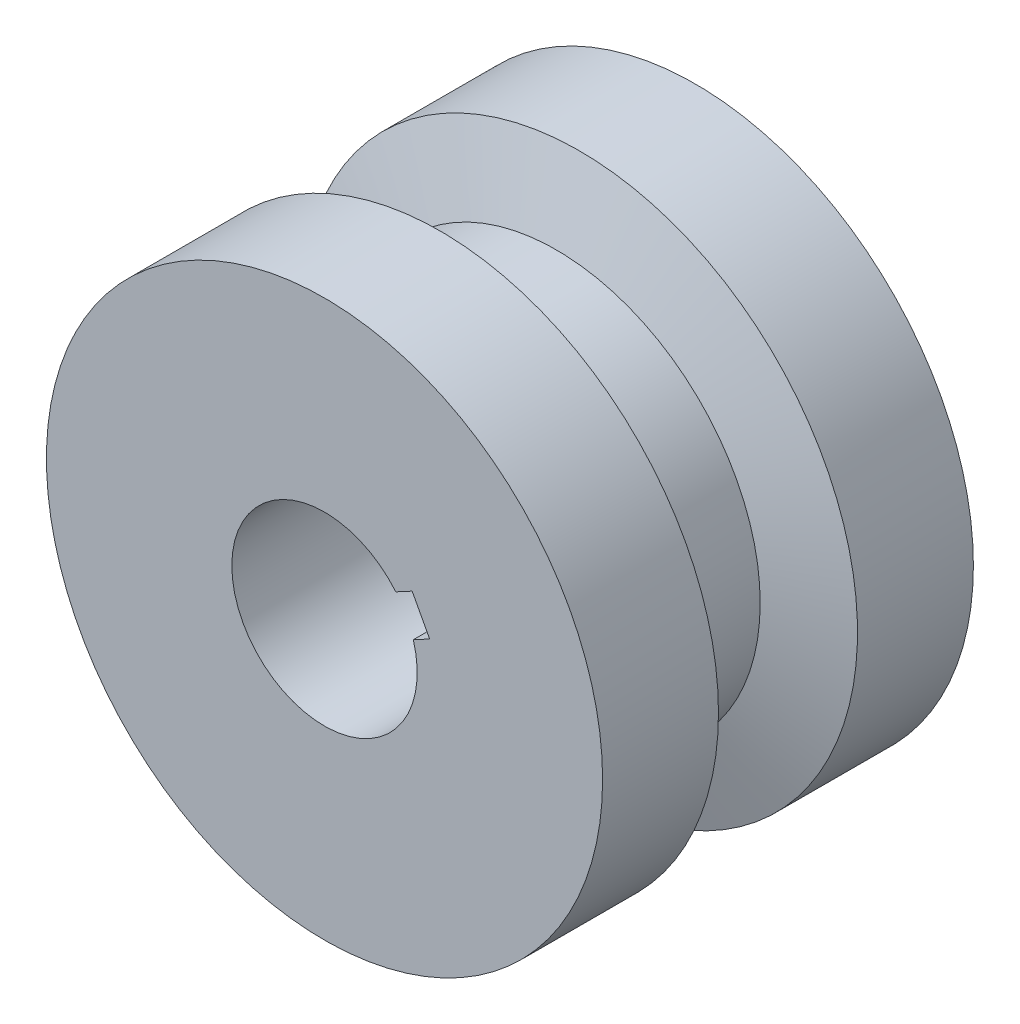
ISO-10303-21;
HEADER;
FILE_DESCRIPTION(('STEP AP214'),'2;1');
FILE_NAME('part.step','',(''),(''),'','','');
FILE_SCHEMA(('AUTOMOTIVE_DESIGN { 1 0 10303 214 1 1 1 1 }'));
ENDSEC;
DATA;
#1=APPLICATION_CONTEXT('core data for automotive mechanical design processes');
#2=APPLICATION_PROTOCOL_DEFINITION('international standard','automotive_design',2000,#1);
#3=PRODUCT_CONTEXT('',#1,'mechanical');
#4=PRODUCT('Part','Part','',(#3));
#5=PRODUCT_RELATED_PRODUCT_CATEGORY('part','',(#4));
#6=PRODUCT_DEFINITION_FORMATION('','',#4);
#7=PRODUCT_DEFINITION_CONTEXT('part definition',#1,'design');
#8=PRODUCT_DEFINITION('design','',#6,#7);
#9=PRODUCT_DEFINITION_SHAPE('','',#8);
#10=(LENGTH_UNIT() NAMED_UNIT(*) SI_UNIT(.MILLI.,.METRE.));
#11=(NAMED_UNIT(*) PLANE_ANGLE_UNIT() SI_UNIT($,.RADIAN.));
#12=(NAMED_UNIT(*) SI_UNIT($,.STERADIAN.) SOLID_ANGLE_UNIT());
#13=UNCERTAINTY_MEASURE_WITH_UNIT(LENGTH_MEASURE(1.E-05),#10,'distance_accuracy_value','');
#14=(GEOMETRIC_REPRESENTATION_CONTEXT(3) GLOBAL_UNCERTAINTY_ASSIGNED_CONTEXT((#13)) GLOBAL_UNIT_ASSIGNED_CONTEXT((#10,
#11,#12)) REPRESENTATION_CONTEXT('',''));
#15=CARTESIAN_POINT('',(0.,0.,0.));
#16=DIRECTION('',(0.,0.,1.));
#17=DIRECTION('',(1.,0.,0.));
#18=AXIS2_PLACEMENT_3D('',#15,#16,#17);
#19=CARTESIAN_POINT('',(0.,0.,5.));
#20=DIRECTION('',(0.,0.,-1.));
#21=DIRECTION('',(-1.,0.,0.));
#22=AXIS2_PLACEMENT_3D('',#19,#20,#21);
#23=CYLINDRICAL_SURFACE('',#22,7.5);
#24=CARTESIAN_POINT('',(0.,0.,5.));
#25=DIRECTION('',(0.,0.,1.));
#26=DIRECTION('',(1.,0.,0.));
#27=AXIS2_PLACEMENT_3D('',#24,#25,#26);
#28=CIRCLE('',#27,7.5);
#29=CARTESIAN_POINT('',(7.5,0.,5.));
#30=VERTEX_POINT('',#29);
#31=EDGE_CURVE('E13',#30,#30,#28,.T.);
#32=ORIENTED_EDGE('',*,*,#31,.F.);
#33=EDGE_LOOP('',(#32));
#34=FACE_BOUND('',#33,.T.);
#35=CARTESIAN_POINT('',(0.,0.,1.875));
#36=DIRECTION('',(0.,0.,1.));
#37=DIRECTION('',(1.,0.,0.));
#38=AXIS2_PLACEMENT_3D('',#35,#36,#37);
#39=CIRCLE('',#38,7.5);
#40=CARTESIAN_POINT('',(7.5,0.,1.875));
#41=VERTEX_POINT('',#40);
#42=EDGE_CURVE('E49',#41,#41,#39,.F.);
#43=ORIENTED_EDGE('',*,*,#42,.F.);
#44=EDGE_LOOP('',(#43));
#45=FACE_BOUND('',#44,.T.);
#46=ADVANCED_FACE('F46',(#34,#45),#23,.T.);
#47=CARTESIAN_POINT('',(0.,0.,-5.));
#48=DIRECTION('',(0.,0.,1.));
#49=DIRECTION('',(1.,0.,0.));
#50=AXIS2_PLACEMENT_3D('',#47,#48,#49);
#51=CIRCLE('',#50,7.5);
#52=CARTESIAN_POINT('',(7.5,0.,-5.));
#53=VERTEX_POINT('',#52);
#54=EDGE_CURVE('E54',#53,#53,#51,.T.);
#55=ORIENTED_EDGE('',*,*,#54,.T.);
#56=EDGE_LOOP('',(#55));
#57=FACE_BOUND('',#56,.T.);
#58=CARTESIAN_POINT('',(0.,0.,-1.875));
#59=DIRECTION('',(0.,0.,-1.));
#60=DIRECTION('',(-1.,0.,0.));
#61=AXIS2_PLACEMENT_3D('',#58,#59,#60);
#62=CIRCLE('',#61,7.5);
#63=CARTESIAN_POINT('',(-7.5,0.,-1.875));
#64=VERTEX_POINT('',#63);
#65=EDGE_CURVE('E127',#64,#64,#62,.F.);
#66=ORIENTED_EDGE('',*,*,#65,.F.);
#67=EDGE_LOOP('',(#66));
#68=FACE_BOUND('',#67,.T.);
#69=ADVANCED_FACE('F142',(#57,#68),#23,.T.);
#70=CARTESIAN_POINT('',(0.,0.,5.));
#71=DIRECTION('',(0.,0.,1.));
#72=DIRECTION('',(1.,0.,0.));
#73=AXIS2_PLACEMENT_3D('',#70,#71,#72);
#74=PLANE('',#73);
#75=DIRECTION('',(-0.881462672280858,-0.472253700224243,0.));
#76=VECTOR('',#75,1.);
#77=CARTESIAN_POINT('',(2.39526062451033,0.716049258550253,5.));
#78=LINE('',#77,#76);
#79=CARTESIAN_POINT('',(2.83599196065076,0.952176108662375,5.));
#80=VERTEX_POINT('',#79);
#81=CARTESIAN_POINT('',(2.39526062451033,0.716049258550253,5.));
#82=VERTEX_POINT('',#81);
#83=EDGE_CURVE('E104',#80,#82,#78,.T.);
#84=ORIENTED_EDGE('',*,*,#83,.T.);
#85=CARTESIAN_POINT('',(0.,0.,5.));
#86=DIRECTION('',(0.,0.,1.));
#87=DIRECTION('',(1.,0.,0.));
#88=AXIS2_PLACEMENT_3D('',#85,#86,#87);
#89=CIRCLE('',#88,2.5);
#90=CARTESIAN_POINT('',(1.92300692428609,1.59751193083111,5.));
#91=VERTEX_POINT('',#90);
#92=EDGE_CURVE('E110',#91,#82,#89,.T.);
#93=ORIENTED_EDGE('',*,*,#92,.F.);
#94=DIRECTION('',(0.881462672280858,0.472253700224243,0.));
#95=VECTOR('',#94,1.);
#96=CARTESIAN_POINT('',(2.36373826042652,1.83363878094323,5.));
#97=LINE('',#96,#95);
#98=CARTESIAN_POINT('',(2.36373826042652,1.83363878094323,5.));
#99=VERTEX_POINT('',#98);
#100=EDGE_CURVE('E62',#91,#99,#97,.T.);
#101=ORIENTED_EDGE('',*,*,#100,.T.);
#102=DIRECTION('',(0.472253700224242,-0.881462672280858,0.));
#103=VECTOR('',#102,1.);
#104=CARTESIAN_POINT('',(2.83599196065076,0.952176108662375,5.));
#105=LINE('',#104,#103);
#106=EDGE_CURVE('E101',#99,#80,#105,.T.);
#107=ORIENTED_EDGE('',*,*,#106,.T.);
#108=EDGE_LOOP('',(#84,#93,#101,#107));
#109=FACE_BOUND('',#108,.T.);
#110=ORIENTED_EDGE('',*,*,#31,.T.);
#111=EDGE_LOOP('',(#110));
#112=FACE_BOUND('',#111,.T.);
#113=ADVANCED_FACE('F107',(#109,#112),#74,.T.);
#114=CARTESIAN_POINT('',(0.,0.,-5.));
#115=DIRECTION('',(0.,0.,1.));
#116=DIRECTION('',(1.,0.,0.));
#117=AXIS2_PLACEMENT_3D('',#114,#115,#116);
#118=PLANE('',#117);
#119=ORIENTED_EDGE('',*,*,#54,.F.);
#120=EDGE_LOOP('',(#119));
#121=FACE_BOUND('',#120,.T.);
#122=CARTESIAN_POINT('',(0.,0.,-5.));
#123=DIRECTION('',(0.,0.,1.));
#124=DIRECTION('',(1.,0.,0.));
#125=AXIS2_PLACEMENT_3D('',#122,#123,#124);
#126=CIRCLE('',#125,2.5);
#127=CARTESIAN_POINT('',(1.92300692428609,1.59751193083111,-5.));
#128=VERTEX_POINT('',#127);
#129=CARTESIAN_POINT('',(2.39526062451033,0.716049258550253,-5.));
#130=VERTEX_POINT('',#129);
#131=EDGE_CURVE('E129',#128,#130,#126,.T.);
#132=ORIENTED_EDGE('',*,*,#131,.T.);
#133=DIRECTION('',(-0.881462672280858,-0.472253700224243,0.));
#134=VECTOR('',#133,1.);
#135=CARTESIAN_POINT('',(2.39526062451033,0.716049258550253,-5.));
#136=LINE('',#135,#134);
#137=CARTESIAN_POINT('',(2.83599196065076,0.952176108662375,-5.));
#138=VERTEX_POINT('',#137);
#139=EDGE_CURVE('E87',#138,#130,#136,.T.);
#140=ORIENTED_EDGE('',*,*,#139,.F.);
#141=DIRECTION('',(0.472253700224242,-0.881462672280858,0.));
#142=VECTOR('',#141,1.);
#143=CARTESIAN_POINT('',(2.83599196065076,0.952176108662375,-5.));
#144=LINE('',#143,#142);
#145=CARTESIAN_POINT('',(2.36373826042652,1.83363878094323,-5.));
#146=VERTEX_POINT('',#145);
#147=EDGE_CURVE('E112',#146,#138,#144,.T.);
#148=ORIENTED_EDGE('',*,*,#147,.F.);
#149=DIRECTION('',(0.881462672280858,0.472253700224243,0.));
#150=VECTOR('',#149,1.);
#151=CARTESIAN_POINT('',(2.36373826042652,1.83363878094323,-5.));
#152=LINE('',#151,#150);
#153=EDGE_CURVE('E93',#128,#146,#152,.T.);
#154=ORIENTED_EDGE('',*,*,#153,.F.);
#155=EDGE_LOOP('',(#132,#140,#148,#154));
#156=FACE_BOUND('',#155,.T.);
#157=ADVANCED_FACE('F150',(#121,#156),#118,.F.);
#158=CARTESIAN_POINT('',(0.,0.,5.));
#159=DIRECTION('',(0.,0.,-1.));
#160=DIRECTION('',(-1.,0.,0.));
#161=AXIS2_PLACEMENT_3D('',#158,#159,#160);
#162=CYLINDRICAL_SURFACE('',#161,2.5);
#163=DIRECTION('',(0.,0.,-1.));
#164=VECTOR('',#163,1.);
#165=CARTESIAN_POINT('',(2.39526062451033,0.716049258550253,5.));
#166=LINE('',#165,#164);
#167=EDGE_CURVE('E71',#82,#130,#166,.T.);
#168=ORIENTED_EDGE('',*,*,#167,.T.);
#169=ORIENTED_EDGE('',*,*,#131,.F.);
#170=DIRECTION('',(0.,0.,-1.));
#171=VECTOR('',#170,1.);
#172=CARTESIAN_POINT('',(1.92300692428609,1.59751193083111,5.));
#173=LINE('',#172,#171);
#174=EDGE_CURVE('E98',#91,#128,#173,.T.);
#175=ORIENTED_EDGE('',*,*,#174,.F.);
#176=ORIENTED_EDGE('',*,*,#92,.T.);
#177=EDGE_LOOP('',(#168,#169,#175,#176));
#178=FACE_BOUND('',#177,.T.);
#179=ADVANCED_FACE('F156',(#178),#162,.F.);
#180=CARTESIAN_POINT('',(0.,0.,2.5));
#181=DIRECTION('',(0.,0.,1.));
#182=DIRECTION('',(1.,0.,0.));
#183=AXIS2_PLACEMENT_3D('',#180,#181,#182);
#184=CONICAL_SURFACE('',#183,9.5,1.26791145841992);
#185=CARTESIAN_POINT('',(0.,0.,1.25));
#186=DIRECTION('',(0.,0.,1.));
#187=DIRECTION('',(1.,0.,0.));
#188=AXIS2_PLACEMENT_3D('',#185,#186,#187);
#189=CIRCLE('',#188,5.5);
#190=CARTESIAN_POINT('',(5.5,0.,1.25));
#191=VERTEX_POINT('',#190);
#192=EDGE_CURVE('E124',#191,#191,#189,.T.);
#193=ORIENTED_EDGE('',*,*,#192,.T.);
#194=EDGE_LOOP('',(#193));
#195=FACE_BOUND('',#194,.T.);
#196=ORIENTED_EDGE('',*,*,#42,.T.);
#197=EDGE_LOOP('',(#196));
#198=FACE_BOUND('',#197,.T.);
#199=ADVANCED_FACE('F139',(#195,#198),#184,.T.);
#200=CARTESIAN_POINT('',(0.,0.,-1.25));
#201=DIRECTION('',(0.,0.,-1.));
#202=DIRECTION('',(-1.,0.,0.));
#203=AXIS2_PLACEMENT_3D('',#200,#201,#202);
#204=CONICAL_SURFACE('',#203,5.5,1.26791145841992);
#205=CARTESIAN_POINT('',(0.,0.,-1.25));
#206=DIRECTION('',(0.,0.,1.));
#207=DIRECTION('',(1.,0.,0.));
#208=AXIS2_PLACEMENT_3D('',#205,#206,#207);
#209=CIRCLE('',#208,5.5);
#210=CARTESIAN_POINT('',(5.5,0.,-1.25));
#211=VERTEX_POINT('',#210);
#212=EDGE_CURVE('E119',#211,#211,#209,.T.);
#213=ORIENTED_EDGE('',*,*,#212,.F.);
#214=EDGE_LOOP('',(#213));
#215=FACE_BOUND('',#214,.T.);
#216=ORIENTED_EDGE('',*,*,#65,.T.);
#217=EDGE_LOOP('',(#216));
#218=FACE_BOUND('',#217,.T.);
#219=ADVANCED_FACE('F164',(#215,#218),#204,.T.);
#220=CARTESIAN_POINT('',(0.,0.,9.74755767753371));
#221=DIRECTION('',(0.,0.,1.));
#222=DIRECTION('',(1.,0.,0.));
#223=AXIS2_PLACEMENT_3D('',#220,#221,#222);
#224=CYLINDRICAL_SURFACE('',#223,5.5);
#225=ORIENTED_EDGE('',*,*,#212,.T.);
#226=EDGE_LOOP('',(#225));
#227=FACE_BOUND('',#226,.T.);
#228=ORIENTED_EDGE('',*,*,#192,.F.);
#229=EDGE_LOOP('',(#228));
#230=FACE_BOUND('',#229,.T.);
#231=ADVANCED_FACE('F166',(#227,#230),#224,.T.);
#232=CARTESIAN_POINT('',(2.39526062451033,0.716049258550253,5.));
#233=DIRECTION('',(0.472253700224243,-0.881462672280858,0.));
#234=DIRECTION('',(0.881462672280858,0.472253700224243,0.));
#235=AXIS2_PLACEMENT_3D('',#232,#233,#234);
#236=PLANE('',#235);
#237=ORIENTED_EDGE('',*,*,#139,.T.);
#238=ORIENTED_EDGE('',*,*,#167,.F.);
#239=ORIENTED_EDGE('',*,*,#83,.F.);
#240=DIRECTION('',(0.,0.,-1.));
#241=VECTOR('',#240,1.);
#242=CARTESIAN_POINT('',(2.83599196065076,0.952176108662375,5.));
#243=LINE('',#242,#241);
#244=EDGE_CURVE('E97',#80,#138,#243,.T.);
#245=ORIENTED_EDGE('',*,*,#244,.T.);
#246=EDGE_LOOP('',(#237,#238,#239,#245));
#247=FACE_BOUND('',#246,.T.);
#248=ADVANCED_FACE('F169',(#247),#236,.F.);
#249=CARTESIAN_POINT('',(2.83599196065076,0.952176108662375,5.));
#250=DIRECTION('',(0.881462672280858,0.472253700224242,0.));
#251=DIRECTION('',(-0.472253700224242,0.881462672280858,0.));
#252=AXIS2_PLACEMENT_3D('',#249,#250,#251);
#253=PLANE('',#252);
#254=ORIENTED_EDGE('',*,*,#147,.T.);
#255=ORIENTED_EDGE('',*,*,#244,.F.);
#256=ORIENTED_EDGE('',*,*,#106,.F.);
#257=DIRECTION('',(0.,0.,-1.));
#258=VECTOR('',#257,1.);
#259=CARTESIAN_POINT('',(2.36373826042652,1.83363878094323,5.));
#260=LINE('',#259,#258);
#261=EDGE_CURVE('E89',#99,#146,#260,.T.);
#262=ORIENTED_EDGE('',*,*,#261,.T.);
#263=EDGE_LOOP('',(#254,#255,#256,#262));
#264=FACE_BOUND('',#263,.T.);
#265=ADVANCED_FACE('F102',(#264),#253,.F.);
#266=CARTESIAN_POINT('',(2.36373826042652,1.83363878094323,5.));
#267=DIRECTION('',(-0.472253700224243,0.881462672280858,0.));
#268=DIRECTION('',(-0.881462672280858,-0.472253700224243,0.));
#269=AXIS2_PLACEMENT_3D('',#266,#267,#268);
#270=PLANE('',#269);
#271=ORIENTED_EDGE('',*,*,#153,.T.);
#272=ORIENTED_EDGE('',*,*,#261,.F.);
#273=ORIENTED_EDGE('',*,*,#100,.F.);
#274=ORIENTED_EDGE('',*,*,#174,.T.);
#275=EDGE_LOOP('',(#271,#272,#273,#274));
#276=FACE_BOUND('',#275,.T.);
#277=ADVANCED_FACE('F91',(#276),#270,.F.);
#278=CLOSED_SHELL('',(#46,#69,#113,#157,#179,#199,#219,#231,#248,#265,#277));
#279=MANIFOLD_SOLID_BREP('B2',#278);
#280=ADVANCED_BREP_SHAPE_REPRESENTATION('',(#18,#279),#14);
#281=SHAPE_DEFINITION_REPRESENTATION(#9,#280);
ENDSEC;
END-ISO-10303-21;
